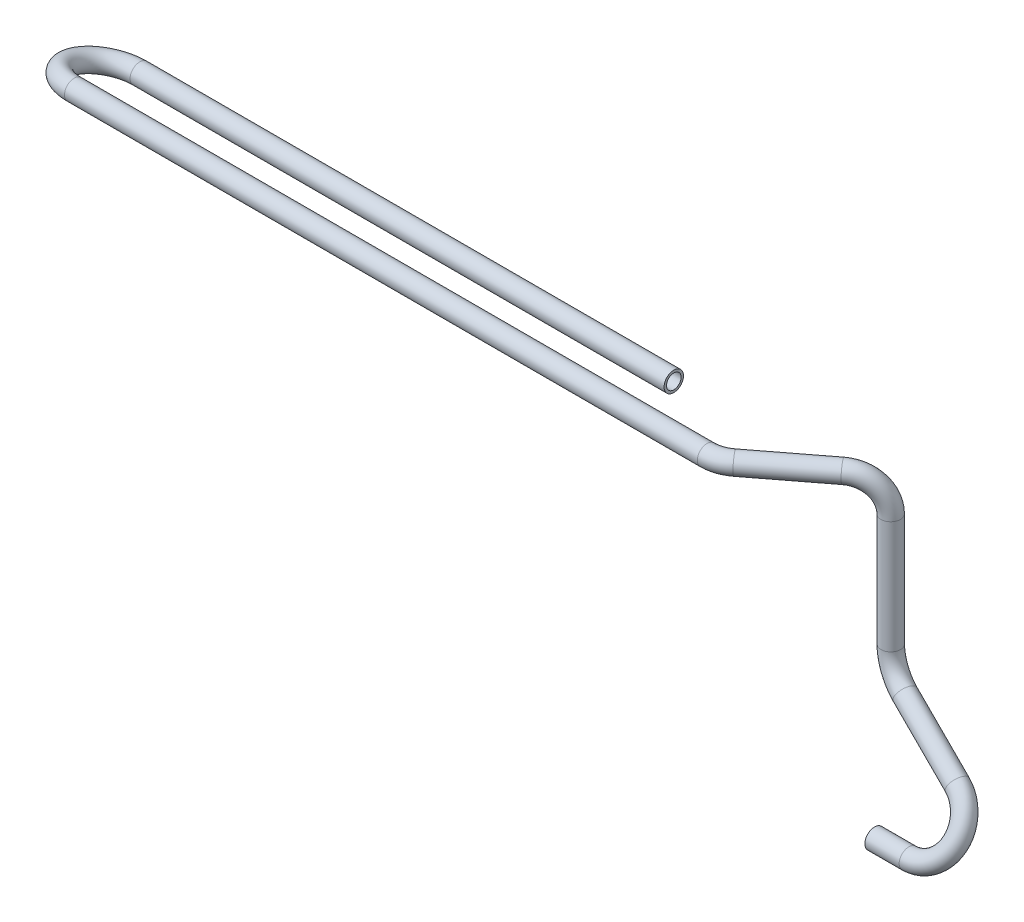
ISO-10303-21;
HEADER;
FILE_DESCRIPTION(('STEP AP214'),'2;1');
FILE_NAME('part.step','',(''),(''),'','','');
FILE_SCHEMA(('AUTOMOTIVE_DESIGN { 1 0 10303 214 1 1 1 1 }'));
ENDSEC;
DATA;
#1=APPLICATION_CONTEXT('core data for automotive mechanical design processes');
#2=APPLICATION_PROTOCOL_DEFINITION('international standard','automotive_design',2000,#1);
#3=PRODUCT_CONTEXT('',#1,'mechanical');
#4=PRODUCT('Part','Part','',(#3));
#5=PRODUCT_RELATED_PRODUCT_CATEGORY('part','',(#4));
#6=PRODUCT_DEFINITION_FORMATION('','',#4);
#7=PRODUCT_DEFINITION_CONTEXT('part definition',#1,'design');
#8=PRODUCT_DEFINITION('design','',#6,#7);
#9=PRODUCT_DEFINITION_SHAPE('','',#8);
#10=(LENGTH_UNIT() NAMED_UNIT(*) SI_UNIT(.MILLI.,.METRE.));
#11=(NAMED_UNIT(*) PLANE_ANGLE_UNIT() SI_UNIT($,.RADIAN.));
#12=(NAMED_UNIT(*) SI_UNIT($,.STERADIAN.) SOLID_ANGLE_UNIT());
#13=UNCERTAINTY_MEASURE_WITH_UNIT(LENGTH_MEASURE(1.E-05),#10,'distance_accuracy_value','');
#14=(GEOMETRIC_REPRESENTATION_CONTEXT(3) GLOBAL_UNCERTAINTY_ASSIGNED_CONTEXT((#13)) GLOBAL_UNIT_ASSIGNED_CONTEXT((#10,
#11,#12)) REPRESENTATION_CONTEXT('',''));
#15=CARTESIAN_POINT('',(0.,0.,0.));
#16=DIRECTION('',(0.,0.,1.));
#17=DIRECTION('',(1.,0.,0.));
#18=AXIS2_PLACEMENT_3D('',#15,#16,#17);
#19=CARTESIAN_POINT('',(-482.1,152.5,-29.3949254238698));
#20=DIRECTION('',(1.,0.,0.));
#21=DIRECTION('',(0.,1.,0.));
#22=AXIS2_PLACEMENT_3D('',#19,#20,#21);
#23=CYLINDRICAL_SURFACE('',#22,6.);
#24=CARTESIAN_POINT('',(-482.1,152.5,-29.3949254238698));
#25=DIRECTION('',(1.,0.,0.));
#26=DIRECTION('',(0.,0.350985459378703,0.936380909301723));
#27=AXIS2_PLACEMENT_3D('',#24,#25,#26);
#28=CIRCLE('',#27,6.);
#29=CARTESIAN_POINT('',(-482.1,150.857142857143,-35.1656290558513));
#30=VERTEX_POINT('',#29);
#31=EDGE_CURVE('E47',#30,#30,#28,.T.);
#32=ORIENTED_EDGE('',*,*,#31,.T.);
#33=EDGE_LOOP('',(#32));
#34=FACE_BOUND('',#33,.T.);
#35=CARTESIAN_POINT('',(-153.1,152.5,-29.3949254238698));
#36=DIRECTION('',(1.,0.,0.));
#37=DIRECTION('',(0.,0.350985459378703,0.936380909301723));
#38=AXIS2_PLACEMENT_3D('',#35,#36,#37);
#39=CIRCLE('',#38,6.);
#40=CARTESIAN_POINT('',(-153.1,154.605912756272,-23.7766399680595));
#41=VERTEX_POINT('',#40);
#42=EDGE_CURVE('E10',#41,#41,#39,.T.);
#43=ORIENTED_EDGE('',*,*,#42,.F.);
#44=EDGE_LOOP('',(#43));
#45=FACE_BOUND('',#44,.T.);
#46=ADVANCED_FACE('F37',(#34,#45),#23,.T.);
#47=CARTESIAN_POINT('',(-482.1,152.5,-29.3949254238698));
#48=DIRECTION('',(1.,0.,0.));
#49=DIRECTION('',(0.,1.,0.));
#50=AXIS2_PLACEMENT_3D('',#47,#48,#49);
#51=CYLINDRICAL_SURFACE('',#50,4.5);
#52=CARTESIAN_POINT('',(-482.1,152.5,-29.3949254238698));
#53=DIRECTION('',(1.,0.,0.));
#54=DIRECTION('',(0.,0.350985459378703,0.936380909301723));
#55=AXIS2_PLACEMENT_3D('',#52,#53,#54);
#56=CIRCLE('',#55,4.5);
#57=CARTESIAN_POINT('',(-482.1,151.267857142857,-33.7229531478559));
#58=VERTEX_POINT('',#57);
#59=EDGE_CURVE('E51',#58,#58,#56,.T.);
#60=ORIENTED_EDGE('',*,*,#59,.F.);
#61=EDGE_LOOP('',(#60));
#62=FACE_BOUND('',#61,.T.);
#63=CARTESIAN_POINT('',(-153.1,152.5,-29.3949254238698));
#64=DIRECTION('',(1.,0.,0.));
#65=DIRECTION('',(0.,0.350985459378703,0.936380909301723));
#66=AXIS2_PLACEMENT_3D('',#63,#64,#65);
#67=CIRCLE('',#66,4.5);
#68=CARTESIAN_POINT('',(-153.1,154.079434567204,-25.1812113320121));
#69=VERTEX_POINT('',#68);
#70=EDGE_CURVE('E43',#69,#69,#67,.T.);
#71=ORIENTED_EDGE('',*,*,#70,.T.);
#72=EDGE_LOOP('',(#71));
#73=FACE_BOUND('',#72,.T.);
#74=ADVANCED_FACE('F183',(#62,#73),#51,.F.);
#75=CARTESIAN_POINT('',(-482.1,158.25,-9.19746271193491));
#76=DIRECTION('',(0.,-0.961783938663566,0.273809523809524));
#77=DIRECTION('',(0.,-0.273809523809524,-0.961783938663566));
#78=AXIS2_PLACEMENT_3D('',#75,#76,#77);
#79=TOROIDAL_SURFACE('',#78,21.0000000000001,6.);
#80=CARTESIAN_POINT('',(-482.1,164.,11.));
#81=DIRECTION('',(-1.,0.,0.));
#82=DIRECTION('',(0.,-0.194826051389988,-0.980837810088797));
#83=AXIS2_PLACEMENT_3D('',#80,#81,#82);
#84=CIRCLE('',#83,6.);
#85=CARTESIAN_POINT('',(-482.1,165.642857142857,16.7707036319814));
#86=VERTEX_POINT('',#85);
#87=EDGE_CURVE('E56',#86,#86,#84,.T.);
#88=CARTESIAN_POINT('',(-482.1,158.25,-9.19746271193491));
#89=DIRECTION('',(0.,-0.961783938663566,0.273809523809524));
#90=DIRECTION('',(0.,-0.273809523809524,-0.961783938663566));
#91=AXIS2_PLACEMENT_3D('',#88,#89,#90);
#92=CIRCLE('',#91,27.0000000000001);
#93=EDGE_CURVE('',#86,#30,#92,.T.);
#94=ORIENTED_EDGE('',*,*,#87,.T.);
#95=ORIENTED_EDGE('',*,*,#31,.F.);
#96=ORIENTED_EDGE('',*,*,#93,.T.);
#97=ORIENTED_EDGE('',*,*,#93,.F.);
#98=EDGE_LOOP('',(#94,#96,#95,#97));
#99=FACE_BOUND('',#98,.T.);
#100=ADVANCED_FACE('F179',(#99),#79,.T.);
#101=CARTESIAN_POINT('',(-482.1,158.25,-9.19746271193491));
#102=DIRECTION('',(0.,-0.961783938663566,0.273809523809524));
#103=DIRECTION('',(0.,-0.273809523809524,-0.961783938663566));
#104=AXIS2_PLACEMENT_3D('',#101,#102,#103);
#105=TOROIDAL_SURFACE('',#104,21.0000000000001,4.5);
#106=CARTESIAN_POINT('',(-482.1,164.,11.));
#107=DIRECTION('',(-1.,0.,0.));
#108=DIRECTION('',(0.,-0.194826051389988,-0.980837810088797));
#109=AXIS2_PLACEMENT_3D('',#106,#107,#108);
#110=CIRCLE('',#109,4.5);
#111=CARTESIAN_POINT('',(-482.1,165.232142857143,15.3280277239861));
#112=VERTEX_POINT('',#111);
#113=EDGE_CURVE('E59',#112,#112,#110,.T.);
#114=CARTESIAN_POINT('',(-482.1,158.25,-9.19746271193491));
#115=DIRECTION('',(0.,-0.961783938663566,0.273809523809524));
#116=DIRECTION('',(0.,-0.273809523809524,-0.961783938663566));
#117=AXIS2_PLACEMENT_3D('',#114,#115,#116);
#118=CIRCLE('',#117,25.5000000000001);
#119=EDGE_CURVE('',#112,#58,#118,.T.);
#120=ORIENTED_EDGE('',*,*,#113,.F.);
#121=ORIENTED_EDGE('',*,*,#59,.T.);
#122=ORIENTED_EDGE('',*,*,#119,.T.);
#123=ORIENTED_EDGE('',*,*,#119,.F.);
#124=EDGE_LOOP('',(#120,#122,#121,#123));
#125=FACE_BOUND('',#124,.T.);
#126=ADVANCED_FACE('F176',(#125),#105,.F.);
#127=CARTESIAN_POINT('',(-92.2236714434914,164.,11.));
#128=DIRECTION('',(-1.,0.,0.));
#129=DIRECTION('',(0.,-1.,0.));
#130=AXIS2_PLACEMENT_3D('',#127,#128,#129);
#131=CYLINDRICAL_SURFACE('',#130,6.);
#132=CARTESIAN_POINT('',(-92.2236714434914,164.,11.));
#133=DIRECTION('',(-1.,0.,0.));
#134=DIRECTION('',(0.,-0.194826051389988,-0.980837810088797));
#135=AXIS2_PLACEMENT_3D('',#132,#133,#134);
#136=CIRCLE('',#135,6.);
#137=CARTESIAN_POINT('',(-92.2236714434914,164.,17.));
#138=VERTEX_POINT('',#137);
#139=EDGE_CURVE('E62',#138,#138,#136,.T.);
#140=ORIENTED_EDGE('',*,*,#139,.T.);
#141=EDGE_LOOP('',(#140));
#142=FACE_BOUND('',#141,.T.);
#143=ORIENTED_EDGE('',*,*,#87,.F.);
#144=EDGE_LOOP('',(#143));
#145=FACE_BOUND('',#144,.T.);
#146=ADVANCED_FACE('F172',(#142,#145),#131,.T.);
#147=CARTESIAN_POINT('',(-92.2236714434914,164.,11.));
#148=DIRECTION('',(-1.,0.,0.));
#149=DIRECTION('',(0.,-1.,0.));
#150=AXIS2_PLACEMENT_3D('',#147,#148,#149);
#151=CYLINDRICAL_SURFACE('',#150,4.5);
#152=CARTESIAN_POINT('',(-92.2236714434914,164.,11.));
#153=DIRECTION('',(-1.,0.,0.));
#154=DIRECTION('',(0.,-0.194826051389988,-0.980837810088797));
#155=AXIS2_PLACEMENT_3D('',#152,#153,#154);
#156=CIRCLE('',#155,4.5);
#157=CARTESIAN_POINT('',(-92.2236714434914,164.,15.5));
#158=VERTEX_POINT('',#157);
#159=EDGE_CURVE('E65',#158,#158,#156,.T.);
#160=ORIENTED_EDGE('',*,*,#159,.F.);
#161=EDGE_LOOP('',(#160));
#162=FACE_BOUND('',#161,.T.);
#163=ORIENTED_EDGE('',*,*,#113,.T.);
#164=EDGE_LOOP('',(#163));
#165=FACE_BOUND('',#164,.T.);
#166=ADVANCED_FACE('F169',(#162,#165),#151,.F.);
#167=CARTESIAN_POINT('',(-92.2236714434914,164.,-10.));
#168=DIRECTION('',(0.,-1.,0.));
#169=DIRECTION('',(0.,0.,-1.));
#170=AXIS2_PLACEMENT_3D('',#167,#168,#169);
#171=TOROIDAL_SURFACE('',#170,21.,6.);
#172=CARTESIAN_POINT('',(-79.4466090266916,164.,6.66573358713026));
#173=DIRECTION('',(-0.793606361291916,0.,0.608431543657135));
#174=DIRECTION('',(-0.596772662869611,-0.194826051389988,-0.778399125482102));
#175=AXIS2_PLACEMENT_3D('',#172,#173,#174);
#176=CIRCLE('',#175,6.);
#177=CARTESIAN_POINT('',(-75.7960197647488,164.,11.4273717548818));
#178=VERTEX_POINT('',#177);
#179=EDGE_CURVE('E68',#178,#178,#176,.T.);
#180=CARTESIAN_POINT('',(-92.2236714434914,164.,-10.));
#181=DIRECTION('',(0.,-1.,0.));
#182=DIRECTION('',(0.,0.,-1.));
#183=AXIS2_PLACEMENT_3D('',#180,#181,#182);
#184=CIRCLE('',#183,27.);
#185=EDGE_CURVE('',#178,#138,#184,.T.);
#186=ORIENTED_EDGE('',*,*,#179,.T.);
#187=ORIENTED_EDGE('',*,*,#139,.F.);
#188=ORIENTED_EDGE('',*,*,#185,.T.);
#189=ORIENTED_EDGE('',*,*,#185,.F.);
#190=EDGE_LOOP('',(#186,#188,#187,#189));
#191=FACE_BOUND('',#190,.T.);
#192=ADVANCED_FACE('F165',(#191),#171,.T.);
#193=CARTESIAN_POINT('',(-92.2236714434914,164.,-10.));
#194=DIRECTION('',(0.,-1.,0.));
#195=DIRECTION('',(0.,0.,-1.));
#196=AXIS2_PLACEMENT_3D('',#193,#194,#195);
#197=TOROIDAL_SURFACE('',#196,21.,4.5);
#198=CARTESIAN_POINT('',(-79.4466090266916,164.,6.66573358713026));
#199=DIRECTION('',(-0.793606361291916,0.,0.608431543657135));
#200=DIRECTION('',(-0.596772662869611,-0.194826051389988,-0.778399125482102));
#201=AXIS2_PLACEMENT_3D('',#198,#199,#200);
#202=CIRCLE('',#201,4.5);
#203=CARTESIAN_POINT('',(-76.7086670802345,164.,10.2369622129439));
#204=VERTEX_POINT('',#203);
#205=EDGE_CURVE('E71',#204,#204,#202,.T.);
#206=CARTESIAN_POINT('',(-92.2236714434914,164.,-10.));
#207=DIRECTION('',(0.,-1.,0.));
#208=DIRECTION('',(0.,0.,-1.));
#209=AXIS2_PLACEMENT_3D('',#206,#207,#208);
#210=CIRCLE('',#209,25.5);
#211=EDGE_CURVE('',#204,#158,#210,.T.);
#212=ORIENTED_EDGE('',*,*,#205,.F.);
#213=ORIENTED_EDGE('',*,*,#159,.T.);
#214=ORIENTED_EDGE('',*,*,#211,.T.);
#215=ORIENTED_EDGE('',*,*,#211,.F.);
#216=EDGE_LOOP('',(#212,#214,#213,#215));
#217=FACE_BOUND('',#216,.T.);
#218=ADVANCED_FACE('F162',(#217),#197,.F.);
#219=CARTESIAN_POINT('',(-41.7530211028523,164.,-22.2326838211465));
#220=DIRECTION('',(-0.793606361291916,0.,0.608431543657136));
#221=DIRECTION('',(0.608431543657136,0.,0.793606361291916));
#222=AXIS2_PLACEMENT_3D('',#219,#220,#221);
#223=CYLINDRICAL_SURFACE('',#222,6.);
#224=CARTESIAN_POINT('',(-41.7530211028523,164.,-22.2326838211465));
#225=DIRECTION('',(-0.793606361291916,0.,0.608431543657135));
#226=DIRECTION('',(-0.596772662869611,-0.194826051389988,-0.778399125482102));
#227=AXIS2_PLACEMENT_3D('',#224,#225,#226);
#228=CIRCLE('',#227,6.);
#229=CARTESIAN_POINT('',(-41.755156807929,169.999998973219,-22.2354695234205));
#230=VERTEX_POINT('',#229);
#231=EDGE_CURVE('E74',#230,#230,#228,.T.);
#232=ORIENTED_EDGE('',*,*,#231,.T.);
#233=EDGE_LOOP('',(#232));
#234=FACE_BOUND('',#233,.T.);
#235=ORIENTED_EDGE('',*,*,#179,.F.);
#236=EDGE_LOOP('',(#235));
#237=FACE_BOUND('',#236,.T.);
#238=ADVANCED_FACE('F158',(#234,#237),#223,.T.);
#239=CARTESIAN_POINT('',(-41.7530211028523,164.,-22.2326838211465));
#240=DIRECTION('',(-0.793606361291916,0.,0.608431543657136));
#241=DIRECTION('',(0.608431543657136,0.,0.793606361291916));
#242=AXIS2_PLACEMENT_3D('',#239,#240,#241);
#243=CYLINDRICAL_SURFACE('',#242,4.5);
#244=CARTESIAN_POINT('',(-41.7530211028523,164.,-22.2326838211465));
#245=DIRECTION('',(-0.793606361291916,0.,0.608431543657135));
#246=DIRECTION('',(-0.596772662869611,-0.194826051389988,-0.778399125482102));
#247=AXIS2_PLACEMENT_3D('',#244,#245,#246);
#248=CIRCLE('',#247,4.5);
#249=CARTESIAN_POINT('',(-41.7546228816599,168.499999229914,-22.234773097852));
#250=VERTEX_POINT('',#249);
#251=EDGE_CURVE('E77',#250,#250,#248,.T.);
#252=ORIENTED_EDGE('',*,*,#251,.F.);
#253=EDGE_LOOP('',(#252));
#254=FACE_BOUND('',#253,.T.);
#255=ORIENTED_EDGE('',*,*,#205,.T.);
#256=EDGE_LOOP('',(#255));
#257=FACE_BOUND('',#256,.T.);
#258=ADVANCED_FACE('F155',(#254,#257),#243,.F.);
#259=CARTESIAN_POINT('',(-41.7455461350838,143.000003593734,-22.2229338631875));
#260=DIRECTION('',(0.608431439536124,0.000585030230323572,0.793606225481901));
#261=DIRECTION('',(0.793606361291916,0.,-0.608431543657136));
#262=AXIS2_PLACEMENT_3D('',#259,#260,#261);
#263=TOROIDAL_SURFACE('',#262,21.,6.);
#264=CARTESIAN_POINT('',(-25.079823104161,143.016028327418,-35.));
#265=DIRECTION('',(-0.000961538017041519,0.999999537722214,0.));
#266=DIRECTION('',(-0.751001489707413,-0.000722116817027579,-0.660300114345402));
#267=AXIS2_PLACEMENT_3D('',#264,#265,#266);
#268=CIRCLE('',#267,6.);
#269=CARTESIAN_POINT('',(-20.3181879524687,143.020606822756,-38.6505903248036));
#270=VERTEX_POINT('',#269);
#271=EDGE_CURVE('E80',#270,#270,#268,.T.);
#272=CARTESIAN_POINT('',(-41.7455461350838,143.000003593734,-22.2229338631875));
#273=DIRECTION('',(0.608431439536124,0.000585030230323572,0.793606225481901));
#274=DIRECTION('',(0.793606361291916,0.,-0.608431543657136));
#275=AXIS2_PLACEMENT_3D('',#272,#273,#274);
#276=CIRCLE('',#275,27.);
#277=EDGE_CURVE('',#270,#230,#276,.T.);
#278=ORIENTED_EDGE('',*,*,#271,.T.);
#279=ORIENTED_EDGE('',*,*,#231,.F.);
#280=ORIENTED_EDGE('',*,*,#277,.T.);
#281=ORIENTED_EDGE('',*,*,#277,.F.);
#282=EDGE_LOOP('',(#278,#280,#279,#281));
#283=FACE_BOUND('',#282,.T.);
#284=ADVANCED_FACE('F151',(#283),#263,.T.);
#285=CARTESIAN_POINT('',(-41.7455461350838,143.000003593734,-22.2229338631875));
#286=DIRECTION('',(0.608431439536124,0.000585030230323572,0.793606225481901));
#287=DIRECTION('',(0.793606361291916,0.,-0.608431543657136));
#288=AXIS2_PLACEMENT_3D('',#285,#286,#287);
#289=TOROIDAL_SURFACE('',#288,21.,4.5);
#290=CARTESIAN_POINT('',(-25.079823104161,143.016028327418,-35.));
#291=DIRECTION('',(-0.000961538017041519,0.999999537722214,0.));
#292=DIRECTION('',(-0.751001489707413,-0.000722116817027579,-0.660300114345402));
#293=AXIS2_PLACEMENT_3D('',#290,#291,#292);
#294=CIRCLE('',#293,4.5);
#295=CARTESIAN_POINT('',(-21.5085967403918,143.019462198921,-37.7379427436027));
#296=VERTEX_POINT('',#295);
#297=EDGE_CURVE('E83',#296,#296,#294,.T.);
#298=CARTESIAN_POINT('',(-41.7455461350838,143.000003593734,-22.2229338631875));
#299=DIRECTION('',(0.608431439536124,0.000585030230323572,0.793606225481901));
#300=DIRECTION('',(0.793606361291916,0.,-0.608431543657136));
#301=AXIS2_PLACEMENT_3D('',#298,#299,#300);
#302=CIRCLE('',#301,25.5);
#303=EDGE_CURVE('',#296,#250,#302,.T.);
#304=ORIENTED_EDGE('',*,*,#297,.F.);
#305=ORIENTED_EDGE('',*,*,#251,.T.);
#306=ORIENTED_EDGE('',*,*,#303,.T.);
#307=ORIENTED_EDGE('',*,*,#303,.F.);
#308=EDGE_LOOP('',(#304,#306,#305,#307));
#309=FACE_BOUND('',#308,.T.);
#310=ADVANCED_FACE('F148',(#309),#289,.F.);
#311=CARTESIAN_POINT('',(-25.013094440981,73.61821862021,-35.));
#312=DIRECTION('',(-0.000961538017040022,0.999999537722214,0.));
#313=DIRECTION('',(-0.999999537722214,-0.000961538017040022,0.));
#314=AXIS2_PLACEMENT_3D('',#311,#312,#313);
#315=CYLINDRICAL_SURFACE('',#314,6.);
#316=CARTESIAN_POINT('',(-25.013094440981,73.61821862021,-35.));
#317=DIRECTION('',(-0.000961538017041519,0.999999537722214,0.));
#318=DIRECTION('',(-0.751001489707413,-0.000722116817027579,-0.660300114345402));
#319=AXIS2_PLACEMENT_3D('',#316,#317,#318);
#320=CIRCLE('',#319,6.);
#321=CARTESIAN_POINT('',(-30.8066122494375,73.6126479300095,-36.5604872221546));
#322=VERTEX_POINT('',#321);
#323=EDGE_CURVE('E86',#322,#322,#320,.T.);
#324=ORIENTED_EDGE('',*,*,#323,.T.);
#325=EDGE_LOOP('',(#324));
#326=FACE_BOUND('',#325,.T.);
#327=ORIENTED_EDGE('',*,*,#271,.F.);
#328=EDGE_LOOP('',(#327));
#329=FACE_BOUND('',#328,.T.);
#330=ADVANCED_FACE('F144',(#326,#329),#315,.T.);
#331=CARTESIAN_POINT('',(-25.013094440981,73.61821862021,-35.));
#332=DIRECTION('',(-0.000961538017040022,0.999999537722214,0.));
#333=DIRECTION('',(-0.999999537722214,-0.000961538017040022,0.));
#334=AXIS2_PLACEMENT_3D('',#331,#332,#333);
#335=CYLINDRICAL_SURFACE('',#334,4.5);
#336=CARTESIAN_POINT('',(-25.013094440981,73.61821862021,-35.));
#337=DIRECTION('',(-0.000961538017041519,0.999999537722214,0.));
#338=DIRECTION('',(-0.751001489707413,-0.000722116817027579,-0.660300114345402));
#339=AXIS2_PLACEMENT_3D('',#336,#337,#338);
#340=CIRCLE('',#339,4.5);
#341=CARTESIAN_POINT('',(-29.3582327973234,73.6140406025596,-36.170365416616));
#342=VERTEX_POINT('',#341);
#343=EDGE_CURVE('E89',#342,#342,#340,.T.);
#344=ORIENTED_EDGE('',*,*,#343,.F.);
#345=EDGE_LOOP('',(#344));
#346=FACE_BOUND('',#345,.T.);
#347=ORIENTED_EDGE('',*,*,#297,.T.);
#348=EDGE_LOOP('',(#347));
#349=FACE_BOUND('',#348,.T.);
#350=ADVANCED_FACE('F141',(#346,#349),#335,.F.);
#351=CARTESIAN_POINT('',(-4.73578211138318,73.6377160359115,-29.5382947224589));
#352=DIRECTION('',(0.260081083462673,0.000250077964867947,-0.965586747778724));
#353=DIRECTION('',(-0.965586777972135,0.,-0.260081091595277));
#354=AXIS2_PLACEMENT_3D('',#351,#352,#353);
#355=TOROIDAL_SURFACE('',#354,21.,6.);
#356=CARTESIAN_POINT('',(-12.9888673762795,54.4564003275136,-31.766233524383));
#357=DIRECTION('',(-0.881989591018586,0.407072118931654,-0.237458736043466));
#358=DIRECTION('',(-0.237458736043466,-0.819104277956278,-0.522189171192169));
#359=AXIS2_PLACEMENT_3D('',#356,#357,#358);
#360=CIRCLE('',#359,6.);
#361=CARTESIAN_POINT('',(-15.3468917376785,48.9760244108285,-32.4027874677898));
#362=VERTEX_POINT('',#361);
#363=EDGE_CURVE('E92',#362,#362,#360,.T.);
#364=CARTESIAN_POINT('',(-4.73578211138318,73.6377160359115,-29.5382947224589));
#365=DIRECTION('',(0.260081083462673,0.000250077964867947,-0.965586747778724));
#366=DIRECTION('',(-0.965586777972135,0.,-0.260081091595277));
#367=AXIS2_PLACEMENT_3D('',#364,#365,#366);
#368=CIRCLE('',#367,27.);
#369=EDGE_CURVE('',#362,#322,#368,.T.);
#370=ORIENTED_EDGE('',*,*,#363,.T.);
#371=ORIENTED_EDGE('',*,*,#323,.F.);
#372=ORIENTED_EDGE('',*,*,#369,.T.);
#373=ORIENTED_EDGE('',*,*,#369,.F.);
#374=EDGE_LOOP('',(#370,#372,#371,#373));
#375=FACE_BOUND('',#374,.T.);
#376=ADVANCED_FACE('F137',(#375),#355,.T.);
#377=CARTESIAN_POINT('',(-4.73578211138318,73.6377160359115,-29.5382947224589));
#378=DIRECTION('',(0.260081083462673,0.000250077964867947,-0.965586747778724));
#379=DIRECTION('',(-0.965586777972135,0.,-0.260081091595277));
#380=AXIS2_PLACEMENT_3D('',#377,#378,#379);
#381=TOROIDAL_SURFACE('',#380,21.,4.5);
#382=CARTESIAN_POINT('',(-12.9888673762795,54.4564003275136,-31.766233524383));
#383=DIRECTION('',(-0.881989591018586,0.407072118931654,-0.237458736043466));
#384=DIRECTION('',(-0.237458736043466,-0.819104277956278,-0.522189171192169));
#385=AXIS2_PLACEMENT_3D('',#382,#383,#384);
#386=CIRCLE('',#385,4.5);
#387=CARTESIAN_POINT('',(-14.7573856473288,50.3461183899998,-32.2436489819381));
#388=VERTEX_POINT('',#387);
#389=EDGE_CURVE('E95',#388,#388,#386,.T.);
#390=CARTESIAN_POINT('',(-4.73578211138318,73.6377160359115,-29.5382947224589));
#391=DIRECTION('',(0.260081083462673,0.000250077964867947,-0.965586747778724));
#392=DIRECTION('',(-0.965586777972135,0.,-0.260081091595277));
#393=AXIS2_PLACEMENT_3D('',#390,#391,#392);
#394=CIRCLE('',#393,25.5);
#395=EDGE_CURVE('',#388,#342,#394,.T.);
#396=ORIENTED_EDGE('',*,*,#389,.F.);
#397=ORIENTED_EDGE('',*,*,#343,.T.);
#398=ORIENTED_EDGE('',*,*,#395,.T.);
#399=ORIENTED_EDGE('',*,*,#395,.F.);
#400=EDGE_LOOP('',(#396,#398,#397,#399));
#401=FACE_BOUND('',#400,.T.);
#402=ADVANCED_FACE('F134',(#401),#381,.F.);
#403=CARTESIAN_POINT('',(31.0341580303289,34.1380809090788,-19.9138805302961));
#404=DIRECTION('',(-0.881989591018585,0.407072118931657,-0.237458736043465));
#405=DIRECTION('',(-0.419058177461749,-0.907959384500451,0.));
#406=AXIS2_PLACEMENT_3D('',#403,#404,#405);
#407=CYLINDRICAL_SURFACE('',#406,6.);
#408=CARTESIAN_POINT('',(31.0341580303289,34.1380809090788,-19.9138805302961));
#409=DIRECTION('',(-0.881989591018586,0.407072118931654,-0.237458736043466));
#410=DIRECTION('',(-0.237458736043466,-0.819104277956278,-0.522189171192169));
#411=AXIS2_PLACEMENT_3D('',#408,#409,#410);
#412=CIRCLE('',#411,6.);
#413=CARTESIAN_POINT('',(33.8617713362912,38.7091449062822,-22.5803345286647));
#414=VERTEX_POINT('',#413);
#415=EDGE_CURVE('E98',#414,#414,#412,.T.);
#416=ORIENTED_EDGE('',*,*,#415,.T.);
#417=EDGE_LOOP('',(#416));
#418=FACE_BOUND('',#417,.T.);
#419=ORIENTED_EDGE('',*,*,#363,.F.);
#420=EDGE_LOOP('',(#419));
#421=FACE_BOUND('',#420,.T.);
#422=ADVANCED_FACE('F130',(#418,#421),#407,.T.);
#423=CARTESIAN_POINT('',(31.0341580303289,34.1380809090788,-19.9138805302961));
#424=DIRECTION('',(-0.881989591018585,0.407072118931657,-0.237458736043465));
#425=DIRECTION('',(-0.419058177461749,-0.907959384500451,0.));
#426=AXIS2_PLACEMENT_3D('',#423,#424,#425);
#427=CYLINDRICAL_SURFACE('',#426,4.5);
#428=CARTESIAN_POINT('',(31.0341580303289,34.1380809090788,-19.9138805302961));
#429=DIRECTION('',(-0.881989591018586,0.407072118931654,-0.237458736043466));
#430=DIRECTION('',(-0.237458736043466,-0.819104277956278,-0.522189171192169));
#431=AXIS2_PLACEMENT_3D('',#428,#429,#430);
#432=CIRCLE('',#431,4.5);
#433=CARTESIAN_POINT('',(33.1548680098006,37.5663789069813,-21.9137210290725));
#434=VERTEX_POINT('',#433);
#435=EDGE_CURVE('E101',#434,#434,#432,.T.);
#436=ORIENTED_EDGE('',*,*,#435,.F.);
#437=EDGE_LOOP('',(#436));
#438=FACE_BOUND('',#437,.T.);
#439=ORIENTED_EDGE('',*,*,#389,.T.);
#440=EDGE_LOOP('',(#439));
#441=FACE_BOUND('',#440,.T.);
#442=ADVANCED_FACE('F127',(#438,#441),#427,.F.);
#443=CARTESIAN_POINT('',(21.1375114594607,18.1393569188671,-10.5812915360058));
#444=DIRECTION('',(0.,0.503871025524088,0.863778900898432));
#445=DIRECTION('',(0.,-0.863778900898432,0.503871025524088));
#446=AXIS2_PLACEMENT_3D('',#443,#444,#445);
#447=TOROIDAL_SURFACE('',#446,21.,6.);
#448=CARTESIAN_POINT('',(21.1375114594607,0.,0.));
#449=DIRECTION('',(1.,0.,0.));
#450=DIRECTION('',(0.,0.,-1.));
#451=AXIS2_PLACEMENT_3D('',#448,#449,#450);
#452=CIRCLE('',#451,6.);
#453=CARTESIAN_POINT('',(21.1375114594607,-5.1826734053906,3.02322615314453));
#454=VERTEX_POINT('',#453);
#455=EDGE_CURVE('E104',#454,#454,#452,.T.);
#456=CARTESIAN_POINT('',(21.1375114594607,18.1393569188671,-10.5812915360058));
#457=DIRECTION('',(0.,0.503871025524088,0.863778900898432));
#458=DIRECTION('',(0.,-0.863778900898432,0.503871025524088));
#459=AXIS2_PLACEMENT_3D('',#456,#457,#458);
#460=CIRCLE('',#459,27.);
#461=EDGE_CURVE('',#454,#414,#460,.T.);
#462=ORIENTED_EDGE('',*,*,#455,.T.);
#463=ORIENTED_EDGE('',*,*,#415,.F.);
#464=ORIENTED_EDGE('',*,*,#461,.T.);
#465=ORIENTED_EDGE('',*,*,#461,.F.);
#466=EDGE_LOOP('',(#462,#464,#463,#465));
#467=FACE_BOUND('',#466,.T.);
#468=ADVANCED_FACE('F123',(#467),#447,.T.);
#469=CARTESIAN_POINT('',(21.1375114594607,18.1393569188671,-10.5812915360058));
#470=DIRECTION('',(0.,0.503871025524088,0.863778900898432));
#471=DIRECTION('',(0.,-0.863778900898432,0.503871025524088));
#472=AXIS2_PLACEMENT_3D('',#469,#470,#471);
#473=TOROIDAL_SURFACE('',#472,21.,4.5);
#474=CARTESIAN_POINT('',(21.1375114594607,0.,0.));
#475=DIRECTION('',(1.,0.,0.));
#476=DIRECTION('',(0.,0.,-1.));
#477=AXIS2_PLACEMENT_3D('',#474,#475,#476);
#478=CIRCLE('',#477,4.5);
#479=CARTESIAN_POINT('',(21.1375114594607,-3.88700505404295,2.2674196148584));
#480=VERTEX_POINT('',#479);
#481=EDGE_CURVE('E108',#480,#480,#478,.T.);
#482=CARTESIAN_POINT('',(21.1375114594607,18.1393569188671,-10.5812915360058));
#483=DIRECTION('',(0.,0.503871025524088,0.863778900898432));
#484=DIRECTION('',(0.,-0.863778900898432,0.503871025524088));
#485=AXIS2_PLACEMENT_3D('',#482,#483,#484);
#486=CIRCLE('',#485,25.5);
#487=EDGE_CURVE('',#480,#434,#486,.T.);
#488=ORIENTED_EDGE('',*,*,#481,.F.);
#489=ORIENTED_EDGE('',*,*,#435,.T.);
#490=ORIENTED_EDGE('',*,*,#487,.T.);
#491=ORIENTED_EDGE('',*,*,#487,.F.);
#492=EDGE_LOOP('',(#488,#490,#489,#491));
#493=FACE_BOUND('',#492,.T.);
#494=ADVANCED_FACE('F120',(#493),#473,.F.);
#495=CARTESIAN_POINT('',(21.1375114594607,0.,0.));
#496=DIRECTION('',(-1.,0.,0.));
#497=DIRECTION('',(0.,0.,1.));
#498=AXIS2_PLACEMENT_3D('',#495,#496,#497);
#499=CYLINDRICAL_SURFACE('',#498,4.5);
#500=ORIENTED_EDGE('',*,*,#481,.T.);
#501=EDGE_LOOP('',(#500));
#502=FACE_BOUND('',#501,.T.);
#503=CARTESIAN_POINT('',(0.,0.,0.));
#504=DIRECTION('',(1.,0.,0.));
#505=DIRECTION('',(0.,0.,-1.));
#506=AXIS2_PLACEMENT_3D('',#503,#504,#505);
#507=CIRCLE('',#506,4.5);
#508=CARTESIAN_POINT('',(0.,0.,-4.5));
#509=VERTEX_POINT('',#508);
#510=EDGE_CURVE('E109',#509,#509,#507,.T.);
#511=ORIENTED_EDGE('',*,*,#510,.F.);
#512=EDGE_LOOP('',(#511));
#513=FACE_BOUND('',#512,.T.);
#514=ADVANCED_FACE('F117',(#502,#513),#499,.F.);
#515=CARTESIAN_POINT('',(21.1375114594607,0.,0.));
#516=DIRECTION('',(-1.,0.,0.));
#517=DIRECTION('',(0.,0.,1.));
#518=AXIS2_PLACEMENT_3D('',#515,#516,#517);
#519=CYLINDRICAL_SURFACE('',#518,6.);
#520=ORIENTED_EDGE('',*,*,#455,.F.);
#521=EDGE_LOOP('',(#520));
#522=FACE_BOUND('',#521,.T.);
#523=CARTESIAN_POINT('',(0.,0.,0.));
#524=DIRECTION('',(1.,0.,0.));
#525=DIRECTION('',(0.,0.,-1.));
#526=AXIS2_PLACEMENT_3D('',#523,#524,#525);
#527=CIRCLE('',#526,6.);
#528=CARTESIAN_POINT('',(0.,0.,-6.));
#529=VERTEX_POINT('',#528);
#530=EDGE_CURVE('E105',#529,#529,#527,.T.);
#531=ORIENTED_EDGE('',*,*,#530,.T.);
#532=EDGE_LOOP('',(#531));
#533=FACE_BOUND('',#532,.T.);
#534=ADVANCED_FACE('F219',(#522,#533),#519,.T.);
#535=CARTESIAN_POINT('',(-153.1,152.5,-29.3949254238699));
#536=DIRECTION('',(1.,0.,0.));
#537=DIRECTION('',(0.,0.350985459378703,0.936380909301723));
#538=AXIS2_PLACEMENT_3D('',#535,#536,#537);
#539=PLANE('',#538);
#540=ORIENTED_EDGE('',*,*,#70,.F.);
#541=EDGE_LOOP('',(#540));
#542=FACE_BOUND('',#541,.T.);
#543=ORIENTED_EDGE('',*,*,#42,.T.);
#544=EDGE_LOOP('',(#543));
#545=FACE_BOUND('',#544,.T.);
#546=ADVANCED_FACE('F222',(#542,#545),#539,.T.);
#547=CARTESIAN_POINT('',(0.,0.,0.));
#548=DIRECTION('',(1.,0.,0.));
#549=DIRECTION('',(0.,0.,-1.));
#550=AXIS2_PLACEMENT_3D('',#547,#548,#549);
#551=PLANE('',#550);
#552=ORIENTED_EDGE('',*,*,#510,.T.);
#553=EDGE_LOOP('',(#552));
#554=FACE_BOUND('',#553,.T.);
#555=ORIENTED_EDGE('',*,*,#530,.F.);
#556=EDGE_LOOP('',(#555));
#557=FACE_BOUND('',#556,.T.);
#558=ADVANCED_FACE('F224',(#554,#557),#551,.F.);
#559=CLOSED_SHELL('',(#46,#74,#100,#126,#146,#166,#192,#218,#238,#258,#284,#310,#330,#350,#376,
#402,#422,#442,#468,#494,#514,#534,#546,#558));
#560=MANIFOLD_SOLID_BREP('B2',#559);
#561=ADVANCED_BREP_SHAPE_REPRESENTATION('',(#18,#560),#14);
#562=SHAPE_DEFINITION_REPRESENTATION(#9,#561);
ENDSEC;
END-ISO-10303-21;
